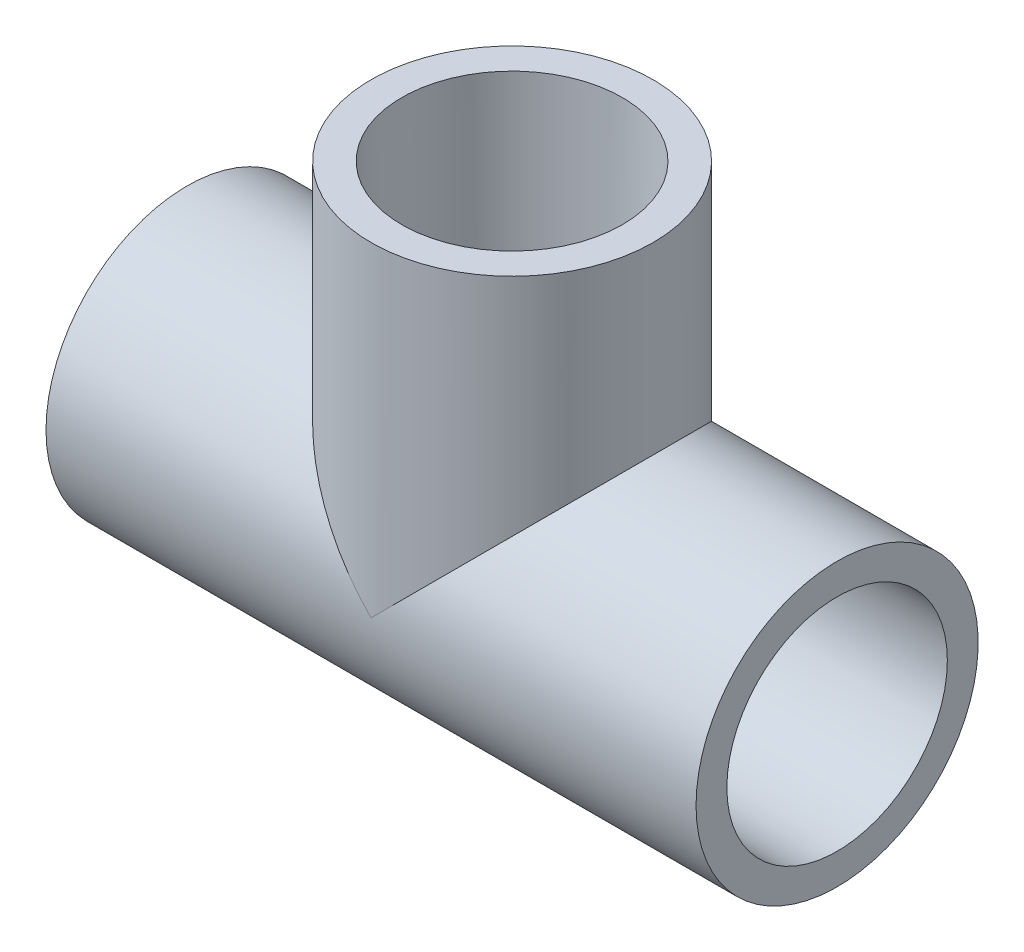
ISO-10303-21;
HEADER;
FILE_DESCRIPTION(('STEP AP214'),'2;1');
FILE_NAME('part.step','',(''),(''),'','','');
FILE_SCHEMA(('AUTOMOTIVE_DESIGN { 1 0 10303 214 1 1 1 1 }'));
ENDSEC;
DATA;
#1=APPLICATION_CONTEXT('core data for automotive mechanical design processes');
#2=APPLICATION_PROTOCOL_DEFINITION('international standard','automotive_design',2000,#1);
#3=PRODUCT_CONTEXT('',#1,'mechanical');
#4=PRODUCT('Part','Part','',(#3));
#5=PRODUCT_RELATED_PRODUCT_CATEGORY('part','',(#4));
#6=PRODUCT_DEFINITION_FORMATION('','',#4);
#7=PRODUCT_DEFINITION_CONTEXT('part definition',#1,'design');
#8=PRODUCT_DEFINITION('design','',#6,#7);
#9=PRODUCT_DEFINITION_SHAPE('','',#8);
#10=(LENGTH_UNIT() NAMED_UNIT(*) SI_UNIT(.MILLI.,.METRE.));
#11=(NAMED_UNIT(*) PLANE_ANGLE_UNIT() SI_UNIT($,.RADIAN.));
#12=(NAMED_UNIT(*) SI_UNIT($,.STERADIAN.) SOLID_ANGLE_UNIT());
#13=UNCERTAINTY_MEASURE_WITH_UNIT(LENGTH_MEASURE(1.E-05),#10,'distance_accuracy_value','');
#14=(GEOMETRIC_REPRESENTATION_CONTEXT(3) GLOBAL_UNCERTAINTY_ASSIGNED_CONTEXT((#13)) GLOBAL_UNIT_ASSIGNED_CONTEXT((#10,
#11,#12)) REPRESENTATION_CONTEXT('',''));
#15=CARTESIAN_POINT('',(0.,0.,0.));
#16=DIRECTION('',(0.,0.,1.));
#17=DIRECTION('',(1.,0.,0.));
#18=AXIS2_PLACEMENT_3D('',#15,#16,#17);
#19=CARTESIAN_POINT('',(-12.7,0.,0.));
#20=DIRECTION('',(1.,0.,0.));
#21=DIRECTION('',(0.,0.,-1.));
#22=AXIS2_PLACEMENT_3D('',#19,#20,#21);
#23=PLANE('',#22);
#24=CARTESIAN_POINT('',(-12.7,0.,0.));
#25=DIRECTION('',(-1.,0.,0.));
#26=DIRECTION('',(0.,0.,1.));
#27=AXIS2_PLACEMENT_3D('',#24,#25,#26);
#28=CIRCLE('',#27,10.6172);
#29=CARTESIAN_POINT('',(-12.7,0.,10.6172));
#30=VERTEX_POINT('',#29);
#31=EDGE_CURVE('E88',#30,#30,#28,.T.);
#32=ORIENTED_EDGE('',*,*,#31,.T.);
#33=EDGE_LOOP('',(#32));
#34=FACE_BOUND('',#33,.T.);
#35=CARTESIAN_POINT('',(-12.7,0.,0.));
#36=DIRECTION('',(1.,0.,0.));
#37=DIRECTION('',(0.,0.,-1.));
#38=AXIS2_PLACEMENT_3D('',#35,#36,#37);
#39=CIRCLE('',#38,7.8994);
#40=CARTESIAN_POINT('',(-12.7,0.,-7.8994));
#41=VERTEX_POINT('',#40);
#42=EDGE_CURVE('E71',#41,#41,#39,.T.);
#43=ORIENTED_EDGE('',*,*,#42,.T.);
#44=EDGE_LOOP('',(#43));
#45=FACE_BOUND('',#44,.T.);
#46=ADVANCED_FACE('F32',(#34,#45),#23,.F.);
#47=CARTESIAN_POINT('',(12.7,0.,0.));
#48=DIRECTION('',(1.,0.,0.));
#49=DIRECTION('',(0.,0.,-1.));
#50=AXIS2_PLACEMENT_3D('',#47,#48,#49);
#51=PLANE('',#50);
#52=CARTESIAN_POINT('',(12.7,0.,0.));
#53=DIRECTION('',(1.,0.,0.));
#54=DIRECTION('',(0.,0.,-1.));
#55=AXIS2_PLACEMENT_3D('',#52,#53,#54);
#56=CIRCLE('',#55,7.8994);
#57=CARTESIAN_POINT('',(12.7,0.,-7.8994));
#58=VERTEX_POINT('',#57);
#59=EDGE_CURVE('E68',#58,#58,#56,.T.);
#60=ORIENTED_EDGE('',*,*,#59,.F.);
#61=EDGE_LOOP('',(#60));
#62=FACE_BOUND('',#61,.T.);
#63=CARTESIAN_POINT('',(12.7,0.,0.));
#64=DIRECTION('',(1.,0.,0.));
#65=DIRECTION('',(0.,0.,-1.));
#66=AXIS2_PLACEMENT_3D('',#63,#64,#65);
#67=CIRCLE('',#66,10.6172);
#68=CARTESIAN_POINT('',(12.7,0.,-10.6172));
#69=VERTEX_POINT('',#68);
#70=EDGE_CURVE('E59',#69,#69,#67,.F.);
#71=ORIENTED_EDGE('',*,*,#70,.F.);
#72=EDGE_LOOP('',(#71));
#73=FACE_BOUND('',#72,.T.);
#74=ADVANCED_FACE('F110',(#62,#73),#51,.T.);
#75=CARTESIAN_POINT('',(12.7,0.,0.));
#76=DIRECTION('',(-1.,0.,0.));
#77=DIRECTION('',(0.,0.,1.));
#78=AXIS2_PLACEMENT_3D('',#75,#76,#77);
#79=CYLINDRICAL_SURFACE('',#78,13.7795);
#80=CARTESIAN_POINT('',(-31.75,0.,0.));
#81=DIRECTION('',(-1.,0.,0.));
#82=DIRECTION('',(0.,0.,1.));
#83=AXIS2_PLACEMENT_3D('',#80,#81,#82);
#84=CIRCLE('',#83,13.7795);
#85=CARTESIAN_POINT('',(-31.75,0.,13.7795));
#86=VERTEX_POINT('',#85);
#87=EDGE_CURVE('E85',#86,#86,#84,.T.);
#88=ORIENTED_EDGE('',*,*,#87,.F.);
#89=EDGE_LOOP('',(#88));
#90=FACE_BOUND('',#89,.T.);
#91=CARTESIAN_POINT('',(31.75,0.,0.));
#92=DIRECTION('',(-1.,0.,0.));
#93=DIRECTION('',(0.,0.,1.));
#94=AXIS2_PLACEMENT_3D('',#91,#92,#93);
#95=CIRCLE('',#94,13.7795);
#96=CARTESIAN_POINT('',(31.75,0.,13.7795));
#97=VERTEX_POINT('',#96);
#98=EDGE_CURVE('E73',#97,#97,#95,.T.);
#99=ORIENTED_EDGE('',*,*,#98,.T.);
#100=EDGE_LOOP('',(#99));
#101=FACE_BOUND('',#100,.T.);
#102=CARTESIAN_POINT('',(0.,0.,0.));
#103=DIRECTION('',(-0.707106781186548,-0.707106781186547,0.));
#104=DIRECTION('',(0.707106781186547,-0.707106781186548,0.));
#105=AXIS2_PLACEMENT_3D('',#102,#103,#104);
#106=ELLIPSE('',#105,19.4871557827201,13.7795);
#107=CARTESIAN_POINT('',(0.,0.,13.7795));
#108=VERTEX_POINT('',#107);
#109=CARTESIAN_POINT('',(0.,0.,-13.7795));
#110=VERTEX_POINT('',#109);
#111=EDGE_CURVE('E94',#108,#110,#106,.T.);
#112=ORIENTED_EDGE('',*,*,#111,.T.);
#113=CARTESIAN_POINT('',(0.,0.,0.));
#114=DIRECTION('',(0.707106781186547,-0.707106781186548,0.));
#115=DIRECTION('',(-0.707106781186548,-0.707106781186547,0.));
#116=AXIS2_PLACEMENT_3D('',#113,#114,#115);
#117=ELLIPSE('',#116,19.4871557827201,13.7795);
#118=EDGE_CURVE('E51',#110,#108,#117,.T.);
#119=ORIENTED_EDGE('',*,*,#118,.T.);
#120=EDGE_LOOP('',(#112,#119));
#121=FACE_BOUND('',#120,.T.);
#122=ADVANCED_FACE('F112',(#90,#101,#121),#79,.T.);
#123=CARTESIAN_POINT('',(-12.7,0.,0.));
#124=DIRECTION('',(-1.,0.,0.));
#125=DIRECTION('',(0.,0.,1.));
#126=AXIS2_PLACEMENT_3D('',#123,#124,#125);
#127=CONICAL_SURFACE('',#126,10.6172,0.00799982933988648);
#128=CARTESIAN_POINT('',(-31.75,0.,0.));
#129=DIRECTION('',(-1.,0.,0.));
#130=DIRECTION('',(0.,0.,1.));
#131=AXIS2_PLACEMENT_3D('',#128,#129,#130);
#132=CIRCLE('',#131,10.7696);
#133=CARTESIAN_POINT('',(-31.75,0.,10.7696));
#134=VERTEX_POINT('',#133);
#135=EDGE_CURVE('E91',#134,#134,#132,.T.);
#136=ORIENTED_EDGE('',*,*,#135,.T.);
#137=EDGE_LOOP('',(#136));
#138=FACE_BOUND('',#137,.T.);
#139=ORIENTED_EDGE('',*,*,#31,.F.);
#140=EDGE_LOOP('',(#139));
#141=FACE_BOUND('',#140,.T.);
#142=ADVANCED_FACE('F119',(#138,#141),#127,.F.);
#143=CARTESIAN_POINT('',(31.75,0.,0.));
#144=DIRECTION('',(1.,0.,0.));
#145=DIRECTION('',(0.,0.,-1.));
#146=AXIS2_PLACEMENT_3D('',#143,#144,#145);
#147=CONICAL_SURFACE('',#146,10.7696,0.00799982933988629);
#148=CARTESIAN_POINT('',(31.75,0.,0.));
#149=DIRECTION('',(-1.,0.,0.));
#150=DIRECTION('',(0.,0.,1.));
#151=AXIS2_PLACEMENT_3D('',#148,#149,#150);
#152=CIRCLE('',#151,10.7696);
#153=CARTESIAN_POINT('',(31.75,0.,10.7696));
#154=VERTEX_POINT('',#153);
#155=EDGE_CURVE('E76',#154,#154,#152,.T.);
#156=ORIENTED_EDGE('',*,*,#155,.F.);
#157=EDGE_LOOP('',(#156));
#158=FACE_BOUND('',#157,.T.);
#159=ORIENTED_EDGE('',*,*,#70,.T.);
#160=EDGE_LOOP('',(#159));
#161=FACE_BOUND('',#160,.T.);
#162=ADVANCED_FACE('F108',(#158,#161),#147,.F.);
#163=CARTESIAN_POINT('',(0.,31.75,0.));
#164=DIRECTION('',(0.,1.,0.));
#165=DIRECTION('',(-1.,0.,0.));
#166=AXIS2_PLACEMENT_3D('',#163,#164,#165);
#167=CONICAL_SURFACE('',#166,10.7696,0.00799982933988657);
#168=CARTESIAN_POINT('',(0.,31.75,0.));
#169=DIRECTION('',(0.,-1.,0.));
#170=DIRECTION('',(1.,0.,0.));
#171=AXIS2_PLACEMENT_3D('',#168,#169,#170);
#172=CIRCLE('',#171,10.7696);
#173=CARTESIAN_POINT('',(10.7696,31.75,0.));
#174=VERTEX_POINT('',#173);
#175=EDGE_CURVE('E96',#174,#174,#172,.T.);
#176=ORIENTED_EDGE('',*,*,#175,.F.);
#177=EDGE_LOOP('',(#176));
#178=FACE_BOUND('',#177,.T.);
#179=CARTESIAN_POINT('',(0.,12.7,0.));
#180=DIRECTION('',(0.,-1.,0.));
#181=DIRECTION('',(1.,0.,0.));
#182=AXIS2_PLACEMENT_3D('',#179,#180,#181);
#183=CIRCLE('',#182,10.6172);
#184=CARTESIAN_POINT('',(10.6172,12.7,0.));
#185=VERTEX_POINT('',#184);
#186=EDGE_CURVE('E99',#185,#185,#183,.T.);
#187=ORIENTED_EDGE('',*,*,#186,.T.);
#188=EDGE_LOOP('',(#187));
#189=FACE_BOUND('',#188,.T.);
#190=ADVANCED_FACE('F128',(#178,#189),#167,.F.);
#191=CARTESIAN_POINT('',(13.7795,31.75,0.));
#192=DIRECTION('',(0.,1.,0.));
#193=DIRECTION('',(-1.,0.,0.));
#194=AXIS2_PLACEMENT_3D('',#191,#192,#193);
#195=PLANE('',#194);
#196=ORIENTED_EDGE('',*,*,#175,.T.);
#197=EDGE_LOOP('',(#196));
#198=FACE_BOUND('',#197,.T.);
#199=CARTESIAN_POINT('',(0.,31.75,0.));
#200=DIRECTION('',(0.,-1.,0.));
#201=DIRECTION('',(1.,0.,0.));
#202=AXIS2_PLACEMENT_3D('',#199,#200,#201);
#203=CIRCLE('',#202,13.7795);
#204=CARTESIAN_POINT('',(13.7795,31.75,0.));
#205=VERTEX_POINT('',#204);
#206=EDGE_CURVE('E102',#205,#205,#203,.T.);
#207=ORIENTED_EDGE('',*,*,#206,.F.);
#208=EDGE_LOOP('',(#207));
#209=FACE_BOUND('',#208,.T.);
#210=ADVANCED_FACE('F34',(#198,#209),#195,.T.);
#211=CARTESIAN_POINT('',(0.,0.,0.));
#212=DIRECTION('',(0.,-1.,0.));
#213=DIRECTION('',(1.,0.,0.));
#214=AXIS2_PLACEMENT_3D('',#211,#212,#213);
#215=CYLINDRICAL_SURFACE('',#214,13.7795);
#216=ORIENTED_EDGE('',*,*,#118,.F.);
#217=ORIENTED_EDGE('',*,*,#111,.F.);
#218=EDGE_LOOP('',(#216,#217));
#219=FACE_BOUND('',#218,.T.);
#220=ORIENTED_EDGE('',*,*,#206,.T.);
#221=EDGE_LOOP('',(#220));
#222=FACE_BOUND('',#221,.T.);
#223=ADVANCED_FACE('F131',(#219,#222),#215,.T.);
#224=CARTESIAN_POINT('',(-31.75,-13.7795,0.));
#225=DIRECTION('',(-1.,0.,0.));
#226=DIRECTION('',(0.,0.,1.));
#227=AXIS2_PLACEMENT_3D('',#224,#225,#226);
#228=PLANE('',#227);
#229=ORIENTED_EDGE('',*,*,#87,.T.);
#230=EDGE_LOOP('',(#229));
#231=FACE_BOUND('',#230,.T.);
#232=ORIENTED_EDGE('',*,*,#135,.F.);
#233=EDGE_LOOP('',(#232));
#234=FACE_BOUND('',#233,.T.);
#235=ADVANCED_FACE('F125',(#231,#234),#228,.T.);
#236=CARTESIAN_POINT('',(31.75,-13.7795,0.));
#237=DIRECTION('',(1.,0.,0.));
#238=DIRECTION('',(0.,0.,-1.));
#239=AXIS2_PLACEMENT_3D('',#236,#237,#238);
#240=PLANE('',#239);
#241=ORIENTED_EDGE('',*,*,#155,.T.);
#242=EDGE_LOOP('',(#241));
#243=FACE_BOUND('',#242,.T.);
#244=ORIENTED_EDGE('',*,*,#98,.F.);
#245=EDGE_LOOP('',(#244));
#246=FACE_BOUND('',#245,.T.);
#247=ADVANCED_FACE('F137',(#243,#246),#240,.T.);
#248=CARTESIAN_POINT('',(0.,12.7,0.));
#249=DIRECTION('',(0.,-1.,0.));
#250=DIRECTION('',(1.,0.,0.));
#251=AXIS2_PLACEMENT_3D('',#248,#249,#250);
#252=PLANE('',#251);
#253=CARTESIAN_POINT('',(0.,12.7,0.));
#254=DIRECTION('',(0.,-1.,0.));
#255=DIRECTION('',(1.,0.,0.));
#256=AXIS2_PLACEMENT_3D('',#253,#254,#255);
#257=CIRCLE('',#256,7.8994);
#258=CARTESIAN_POINT('',(7.8994,12.7,0.));
#259=VERTEX_POINT('',#258);
#260=EDGE_CURVE('E78',#259,#259,#257,.T.);
#261=ORIENTED_EDGE('',*,*,#260,.T.);
#262=EDGE_LOOP('',(#261));
#263=FACE_BOUND('',#262,.T.);
#264=ORIENTED_EDGE('',*,*,#186,.F.);
#265=EDGE_LOOP('',(#264));
#266=FACE_BOUND('',#265,.T.);
#267=ADVANCED_FACE('F63',(#263,#266),#252,.F.);
#268=CARTESIAN_POINT('',(31.75,0.,0.));
#269=DIRECTION('',(1.,0.,0.));
#270=DIRECTION('',(0.,0.,-1.));
#271=AXIS2_PLACEMENT_3D('',#268,#269,#270);
#272=CYLINDRICAL_SURFACE('',#271,7.8994);
#273=CARTESIAN_POINT('',(0.,0.,0.));
#274=DIRECTION('',(0.707106781186547,-0.707106781186547,0.));
#275=DIRECTION('',(0.707106781186547,0.707106781186547,0.));
#276=AXIS2_PLACEMENT_3D('',#273,#274,#275);
#277=ELLIPSE('',#276,11.17143861461,7.8994);
#278=CARTESIAN_POINT('',(0.,0.,-7.8994));
#279=VERTEX_POINT('',#278);
#280=CARTESIAN_POINT('',(0.,0.,7.8994));
#281=VERTEX_POINT('',#280);
#282=EDGE_CURVE('E11',#279,#281,#277,.T.);
#283=ORIENTED_EDGE('',*,*,#282,.F.);
#284=CARTESIAN_POINT('',(0.,0.,0.));
#285=DIRECTION('',(0.707106781186547,0.707106781186547,0.));
#286=DIRECTION('',(0.707106781186547,-0.707106781186547,0.));
#287=AXIS2_PLACEMENT_3D('',#284,#285,#286);
#288=ELLIPSE('',#287,11.17143861461,7.8994);
#289=EDGE_CURVE('E40',#281,#279,#288,.F.);
#290=ORIENTED_EDGE('',*,*,#289,.F.);
#291=EDGE_LOOP('',(#283,#290));
#292=FACE_BOUND('',#291,.T.);
#293=ORIENTED_EDGE('',*,*,#59,.T.);
#294=EDGE_LOOP('',(#293));
#295=FACE_BOUND('',#294,.T.);
#296=ORIENTED_EDGE('',*,*,#42,.F.);
#297=EDGE_LOOP('',(#296));
#298=FACE_BOUND('',#297,.T.);
#299=ADVANCED_FACE('F60',(#292,#295,#298),#272,.F.);
#300=CARTESIAN_POINT('',(0.,0.,0.));
#301=DIRECTION('',(0.,-1.,0.));
#302=DIRECTION('',(1.,0.,0.));
#303=AXIS2_PLACEMENT_3D('',#300,#301,#302);
#304=CYLINDRICAL_SURFACE('',#303,7.8994);
#305=ORIENTED_EDGE('',*,*,#282,.T.);
#306=ORIENTED_EDGE('',*,*,#289,.T.);
#307=EDGE_LOOP('',(#305,#306));
#308=FACE_BOUND('',#307,.T.);
#309=ORIENTED_EDGE('',*,*,#260,.F.);
#310=EDGE_LOOP('',(#309));
#311=FACE_BOUND('',#310,.T.);
#312=ADVANCED_FACE('F56',(#308,#311),#304,.F.);
#313=CLOSED_SHELL('',(#46,#74,#122,#142,#162,#190,#210,#223,#235,#247,#267,#299,#312));
#314=MANIFOLD_SOLID_BREP('B2',#313);
#315=ADVANCED_BREP_SHAPE_REPRESENTATION('',(#18,#314),#14);
#316=SHAPE_DEFINITION_REPRESENTATION(#9,#315);
ENDSEC;
END-ISO-10303-21;
